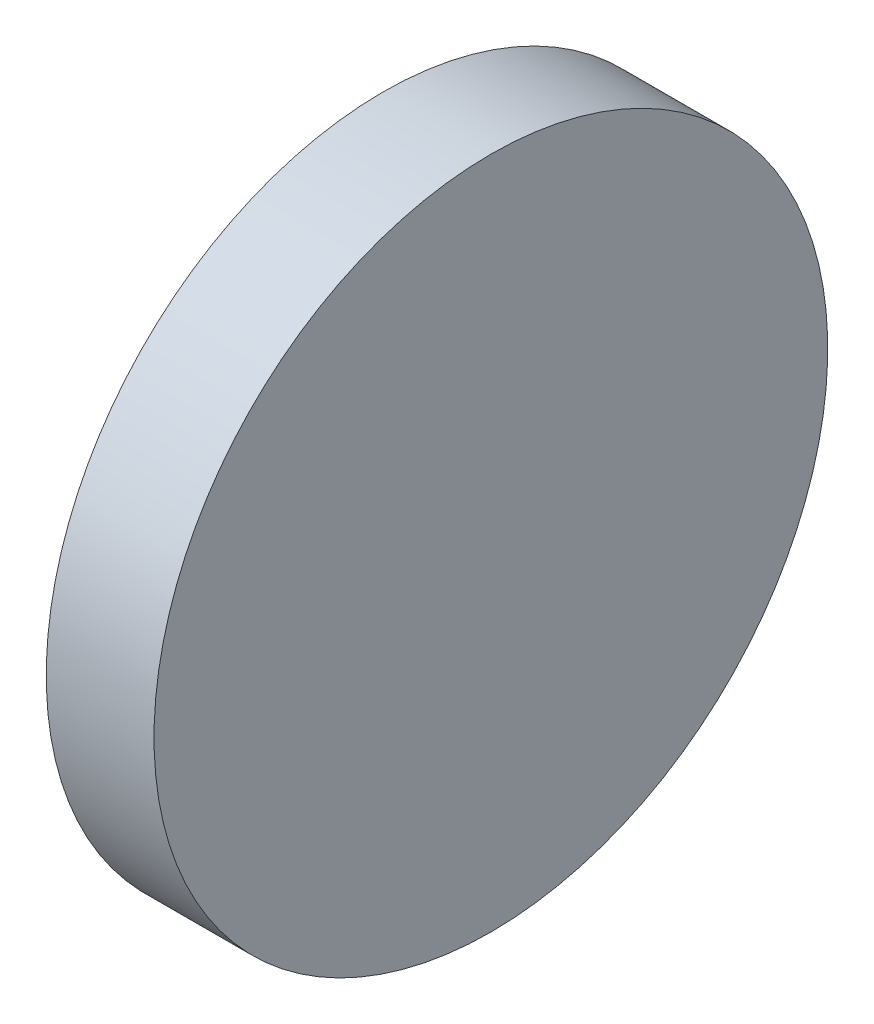
ISO-10303-21;
HEADER;
FILE_DESCRIPTION(('STEP AP214'),'2;1');
FILE_NAME('part.step','',(''),(''),'','','');
FILE_SCHEMA(('AUTOMOTIVE_DESIGN { 1 0 10303 214 1 1 1 1 }'));
ENDSEC;
DATA;
#1=APPLICATION_CONTEXT('core data for automotive mechanical design processes');
#2=APPLICATION_PROTOCOL_DEFINITION('international standard','automotive_design',2000,#1);
#3=PRODUCT_CONTEXT('',#1,'mechanical');
#4=PRODUCT('Part','Part','',(#3));
#5=PRODUCT_RELATED_PRODUCT_CATEGORY('part','',(#4));
#6=PRODUCT_DEFINITION_FORMATION('','',#4);
#7=PRODUCT_DEFINITION_CONTEXT('part definition',#1,'design');
#8=PRODUCT_DEFINITION('design','',#6,#7);
#9=PRODUCT_DEFINITION_SHAPE('','',#8);
#10=(LENGTH_UNIT() NAMED_UNIT(*) SI_UNIT(.MILLI.,.METRE.));
#11=(NAMED_UNIT(*) PLANE_ANGLE_UNIT() SI_UNIT($,.RADIAN.));
#12=(NAMED_UNIT(*) SI_UNIT($,.STERADIAN.) SOLID_ANGLE_UNIT());
#13=UNCERTAINTY_MEASURE_WITH_UNIT(LENGTH_MEASURE(1.E-05),#10,'distance_accuracy_value','');
#14=(GEOMETRIC_REPRESENTATION_CONTEXT(3) GLOBAL_UNCERTAINTY_ASSIGNED_CONTEXT((#13)) GLOBAL_UNIT_ASSIGNED_CONTEXT((#10,
#11,#12)) REPRESENTATION_CONTEXT('',''));
#15=CARTESIAN_POINT('',(0.,0.,0.));
#16=DIRECTION('',(0.,0.,1.));
#17=DIRECTION('',(1.,0.,0.));
#18=AXIS2_PLACEMENT_3D('',#15,#16,#17);
#19=CARTESIAN_POINT('',(-0.290364285309383,-0.332340218761648,0.1012));
#20=DIRECTION('',(-1.,0.,0.));
#21=DIRECTION('',(0.,-1.,0.));
#22=AXIS2_PLACEMENT_3D('',#19,#20,#21);
#23=PLANE('',#22);
#24=CARTESIAN_POINT('',(-0.290364285309383,-0.332340218761648,0.1012));
#25=DIRECTION('',(1.,0.,0.));
#26=DIRECTION('',(0.,1.,0.));
#27=AXIS2_PLACEMENT_3D('',#24,#25,#26);
#28=CIRCLE('',#27,0.03125);
#29=CARTESIAN_POINT('',(-0.290364285309383,-0.301090218761648,0.1012));
#30=VERTEX_POINT('',#29);
#31=EDGE_CURVE('E18',#30,#30,#28,.F.);
#32=ORIENTED_EDGE('',*,*,#31,.F.);
#33=EDGE_LOOP('',(#32));
#34=FACE_BOUND('',#33,.T.);
#35=ADVANCED_FACE('F15',(#34),#23,.F.);
#36=CARTESIAN_POINT('',(-0.270364285309383,-0.332340218761648,0.1012));
#37=DIRECTION('',(1.,0.,0.));
#38=DIRECTION('',(0.,1.,0.));
#39=AXIS2_PLACEMENT_3D('',#36,#37,#38);
#40=CYLINDRICAL_SURFACE('',#39,0.03125);
#41=CARTESIAN_POINT('',(-0.300364285309383,-0.332340218761648,0.1012));
#42=DIRECTION('',(1.,0.,0.));
#43=DIRECTION('',(0.,1.,0.));
#44=AXIS2_PLACEMENT_3D('',#41,#42,#43);
#45=CIRCLE('',#44,0.03125);
#46=CARTESIAN_POINT('',(-0.300364285309383,-0.301090218761648,0.1012));
#47=VERTEX_POINT('',#46);
#48=EDGE_CURVE('E10',#47,#47,#45,.T.);
#49=ORIENTED_EDGE('',*,*,#48,.T.);
#50=EDGE_LOOP('',(#49));
#51=FACE_BOUND('',#50,.T.);
#52=ORIENTED_EDGE('',*,*,#31,.T.);
#53=EDGE_LOOP('',(#52));
#54=FACE_BOUND('',#53,.T.);
#55=ADVANCED_FACE('F27',(#51,#54),#40,.T.);
#56=CARTESIAN_POINT('',(-0.300364285309383,-0.332340218761648,0.1012));
#57=DIRECTION('',(1.,0.,0.));
#58=DIRECTION('',(0.,1.,0.));
#59=AXIS2_PLACEMENT_3D('',#56,#57,#58);
#60=PLANE('',#59);
#61=ORIENTED_EDGE('',*,*,#48,.F.);
#62=EDGE_LOOP('',(#61));
#63=FACE_BOUND('',#62,.T.);
#64=ADVANCED_FACE('F34',(#63),#60,.F.);
#65=CLOSED_SHELL('',(#35,#55,#64));
#66=MANIFOLD_SOLID_BREP('B1',#65);
#67=ADVANCED_BREP_SHAPE_REPRESENTATION('',(#18,#66),#14);
#68=SHAPE_DEFINITION_REPRESENTATION(#9,#67);
ENDSEC;
END-ISO-10303-21;
